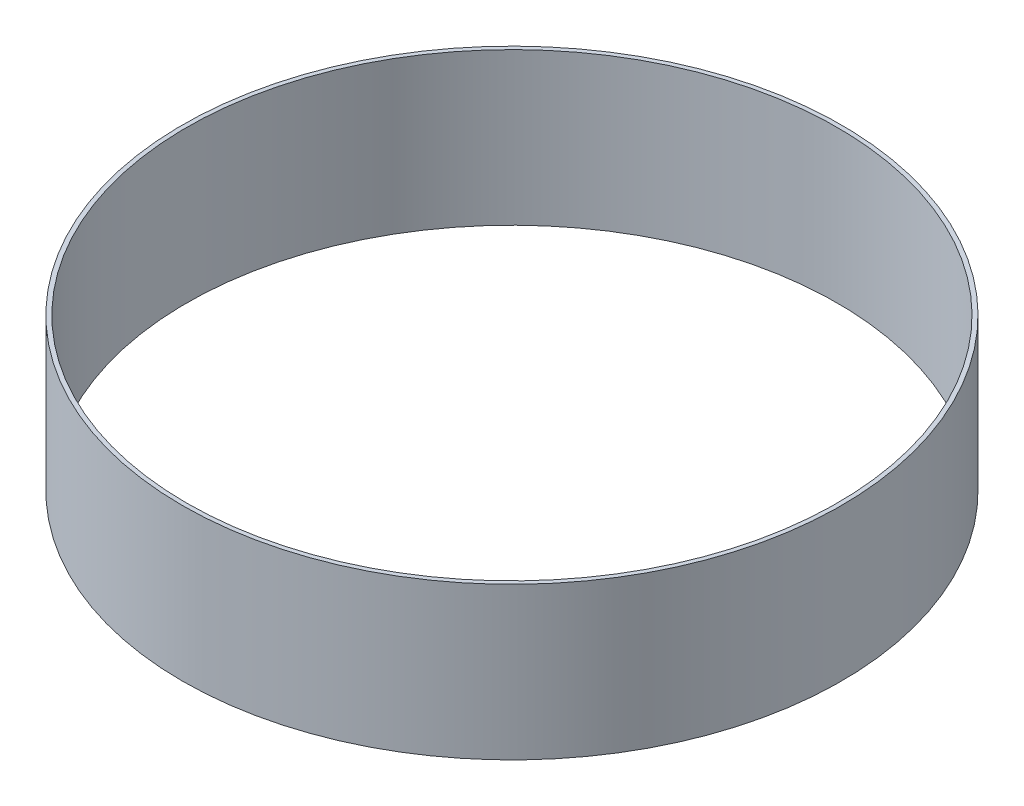
ISO-10303-21;
HEADER;
FILE_DESCRIPTION(('STEP AP214'),'2;1');
FILE_NAME('part.step','',(''),(''),'','','');
FILE_SCHEMA(('AUTOMOTIVE_DESIGN { 1 0 10303 214 1 1 1 1 }'));
ENDSEC;
DATA;
#1=APPLICATION_CONTEXT('core data for automotive mechanical design processes');
#2=APPLICATION_PROTOCOL_DEFINITION('international standard','automotive_design',2000,#1);
#3=PRODUCT_CONTEXT('',#1,'mechanical');
#4=PRODUCT('Part','Part','',(#3));
#5=PRODUCT_RELATED_PRODUCT_CATEGORY('part','',(#4));
#6=PRODUCT_DEFINITION_FORMATION('','',#4);
#7=PRODUCT_DEFINITION_CONTEXT('part definition',#1,'design');
#8=PRODUCT_DEFINITION('design','',#6,#7);
#9=PRODUCT_DEFINITION_SHAPE('','',#8);
#10=(LENGTH_UNIT() NAMED_UNIT(*) SI_UNIT(.MILLI.,.METRE.));
#11=(NAMED_UNIT(*) PLANE_ANGLE_UNIT() SI_UNIT($,.RADIAN.));
#12=(NAMED_UNIT(*) SI_UNIT($,.STERADIAN.) SOLID_ANGLE_UNIT());
#13=UNCERTAINTY_MEASURE_WITH_UNIT(LENGTH_MEASURE(1.E-05),#10,'distance_accuracy_value','');
#14=(GEOMETRIC_REPRESENTATION_CONTEXT(3) GLOBAL_UNCERTAINTY_ASSIGNED_CONTEXT((#13)) GLOBAL_UNIT_ASSIGNED_CONTEXT((#10,
#11,#12)) REPRESENTATION_CONTEXT('',''));
#15=CARTESIAN_POINT('',(0.,0.,0.));
#16=DIRECTION('',(0.,0.,1.));
#17=DIRECTION('',(1.,0.,0.));
#18=AXIS2_PLACEMENT_3D('',#15,#16,#17);
#19=CARTESIAN_POINT('',(0.,114.3,0.));
#20=DIRECTION('',(0.,1.,0.));
#21=DIRECTION('',(0.,0.,1.));
#22=AXIS2_PLACEMENT_3D('',#19,#20,#21);
#23=PLANE('',#22);
#24=CARTESIAN_POINT('',(0.,114.3,0.));
#25=DIRECTION('',(0.,1.,0.));
#26=DIRECTION('',(0.,0.,1.));
#27=AXIS2_PLACEMENT_3D('',#24,#25,#26);
#28=CIRCLE('',#27,247.65);
#29=CARTESIAN_POINT('',(0.,114.3,247.65));
#30=VERTEX_POINT('',#29);
#31=EDGE_CURVE('E10',#30,#30,#28,.T.);
#32=ORIENTED_EDGE('',*,*,#31,.T.);
#33=EDGE_LOOP('',(#32));
#34=FACE_BOUND('',#33,.T.);
#35=CARTESIAN_POINT('',(0.,114.3,0.));
#36=DIRECTION('',(0.,1.,0.));
#37=DIRECTION('',(0.,0.,1.));
#38=AXIS2_PLACEMENT_3D('',#35,#36,#37);
#39=CIRCLE('',#38,244.475);
#40=CARTESIAN_POINT('',(0.,114.3,244.475));
#41=VERTEX_POINT('',#40);
#42=EDGE_CURVE('E50',#41,#41,#39,.T.);
#43=ORIENTED_EDGE('',*,*,#42,.F.);
#44=EDGE_LOOP('',(#43));
#45=FACE_BOUND('',#44,.T.);
#46=ADVANCED_FACE('F37',(#34,#45),#23,.T.);
#47=CARTESIAN_POINT('',(0.,0.,0.));
#48=DIRECTION('',(0.,1.,0.));
#49=DIRECTION('',(0.,0.,1.));
#50=AXIS2_PLACEMENT_3D('',#47,#48,#49);
#51=PLANE('',#50);
#52=CARTESIAN_POINT('',(0.,0.,0.));
#53=DIRECTION('',(0.,1.,0.));
#54=DIRECTION('',(0.,0.,1.));
#55=AXIS2_PLACEMENT_3D('',#52,#53,#54);
#56=CIRCLE('',#55,247.65);
#57=CARTESIAN_POINT('',(0.,0.,247.65));
#58=VERTEX_POINT('',#57);
#59=EDGE_CURVE('E41',#58,#58,#56,.T.);
#60=ORIENTED_EDGE('',*,*,#59,.F.);
#61=EDGE_LOOP('',(#60));
#62=FACE_BOUND('',#61,.T.);
#63=CARTESIAN_POINT('',(0.,0.,0.));
#64=DIRECTION('',(0.,1.,0.));
#65=DIRECTION('',(0.,0.,1.));
#66=AXIS2_PLACEMENT_3D('',#63,#64,#65);
#67=CIRCLE('',#66,244.475);
#68=CARTESIAN_POINT('',(0.,0.,244.475));
#69=VERTEX_POINT('',#68);
#70=EDGE_CURVE('E52',#69,#69,#67,.T.);
#71=ORIENTED_EDGE('',*,*,#70,.T.);
#72=EDGE_LOOP('',(#71));
#73=FACE_BOUND('',#72,.T.);
#74=ADVANCED_FACE('F64',(#62,#73),#51,.F.);
#75=CARTESIAN_POINT('',(0.,114.3,0.));
#76=DIRECTION('',(0.,-1.,0.));
#77=DIRECTION('',(0.,0.,-1.));
#78=AXIS2_PLACEMENT_3D('',#75,#76,#77);
#79=CYLINDRICAL_SURFACE('',#78,247.65);
#80=ORIENTED_EDGE('',*,*,#31,.F.);
#81=EDGE_LOOP('',(#80));
#82=FACE_BOUND('',#81,.T.);
#83=ORIENTED_EDGE('',*,*,#59,.T.);
#84=EDGE_LOOP('',(#83));
#85=FACE_BOUND('',#84,.T.);
#86=ADVANCED_FACE('F39',(#82,#85),#79,.T.);
#87=CARTESIAN_POINT('',(0.,114.3,0.));
#88=DIRECTION('',(0.,-1.,0.));
#89=DIRECTION('',(0.,0.,-1.));
#90=AXIS2_PLACEMENT_3D('',#87,#88,#89);
#91=CYLINDRICAL_SURFACE('',#90,244.475);
#92=ORIENTED_EDGE('',*,*,#42,.T.);
#93=EDGE_LOOP('',(#92));
#94=FACE_BOUND('',#93,.T.);
#95=ORIENTED_EDGE('',*,*,#70,.F.);
#96=EDGE_LOOP('',(#95));
#97=FACE_BOUND('',#96,.T.);
#98=ADVANCED_FACE('F60',(#94,#97),#91,.F.);
#99=CLOSED_SHELL('',(#46,#74,#86,#98));
#100=MANIFOLD_SOLID_BREP('B2',#99);
#101=ADVANCED_BREP_SHAPE_REPRESENTATION('',(#18,#100),#14);
#102=SHAPE_DEFINITION_REPRESENTATION(#9,#101);
ENDSEC;
END-ISO-10303-21;
